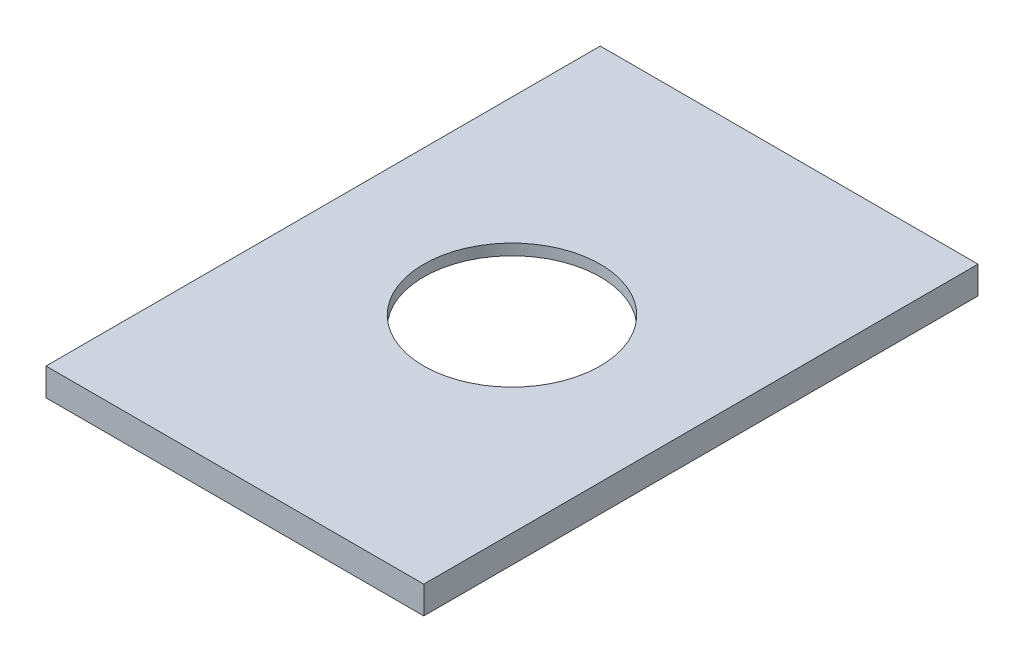
ISO-10303-21;
HEADER;
FILE_DESCRIPTION(('STEP AP214'),'2;1');
FILE_NAME('part.step','',(''),(''),'','','');
FILE_SCHEMA(('AUTOMOTIVE_DESIGN { 1 0 10303 214 1 1 1 1 }'));
ENDSEC;
DATA;
#1=APPLICATION_CONTEXT('core data for automotive mechanical design processes');
#2=APPLICATION_PROTOCOL_DEFINITION('international standard','automotive_design',2000,#1);
#3=PRODUCT_CONTEXT('',#1,'mechanical');
#4=PRODUCT('Part','Part','',(#3));
#5=PRODUCT_RELATED_PRODUCT_CATEGORY('part','',(#4));
#6=PRODUCT_DEFINITION_FORMATION('','',#4);
#7=PRODUCT_DEFINITION_CONTEXT('part definition',#1,'design');
#8=PRODUCT_DEFINITION('design','',#6,#7);
#9=PRODUCT_DEFINITION_SHAPE('','',#8);
#10=(LENGTH_UNIT() NAMED_UNIT(*) SI_UNIT(.MILLI.,.METRE.));
#11=(NAMED_UNIT(*) PLANE_ANGLE_UNIT() SI_UNIT($,.RADIAN.));
#12=(NAMED_UNIT(*) SI_UNIT($,.STERADIAN.) SOLID_ANGLE_UNIT());
#13=UNCERTAINTY_MEASURE_WITH_UNIT(LENGTH_MEASURE(1.E-05),#10,'distance_accuracy_value','');
#14=(GEOMETRIC_REPRESENTATION_CONTEXT(3) GLOBAL_UNCERTAINTY_ASSIGNED_CONTEXT((#13)) GLOBAL_UNIT_ASSIGNED_CONTEXT((#10,
#11,#12)) REPRESENTATION_CONTEXT('',''));
#15=CARTESIAN_POINT('',(0.,0.,0.));
#16=DIRECTION('',(0.,0.,1.));
#17=DIRECTION('',(1.,0.,0.));
#18=AXIS2_PLACEMENT_3D('',#15,#16,#17);
#19=CARTESIAN_POINT('',(0.,2.,0.));
#20=DIRECTION('',(0.,1.,0.));
#21=DIRECTION('',(0.,0.,1.));
#22=AXIS2_PLACEMENT_3D('',#19,#20,#21);
#23=PLANE('',#22);
#24=CARTESIAN_POINT('',(7.75,2.,11.25));
#25=DIRECTION('',(0.,1.,0.));
#26=DIRECTION('',(0.,0.,1.));
#27=AXIS2_PLACEMENT_3D('',#24,#25,#26);
#28=CIRCLE('',#27,16.);
#29=CARTESIAN_POINT('',(7.75,2.,27.25));
#30=VERTEX_POINT('',#29);
#31=EDGE_CURVE('E160',#30,#30,#28,.T.);
#32=ORIENTED_EDGE('',*,*,#31,.F.);
#33=EDGE_LOOP('',(#32));
#34=FACE_BOUND('',#33,.T.);
#35=DIRECTION('',(1.,0.,0.));
#36=VECTOR('',#35,1.);
#37=CARTESIAN_POINT('',(-26.5,2.,-39.));
#38=LINE('',#37,#36);
#39=CARTESIAN_POINT('',(-26.5,2.,-39.));
#40=VERTEX_POINT('',#39);
#41=CARTESIAN_POINT('',(42.,2.,-39.));
#42=VERTEX_POINT('',#41);
#43=EDGE_CURVE('E136',#40,#42,#38,.T.);
#44=ORIENTED_EDGE('',*,*,#43,.F.);
#45=DIRECTION('',(0.,0.,-1.));
#46=VECTOR('',#45,1.);
#47=CARTESIAN_POINT('',(-26.5,2.,61.5));
#48=LINE('',#47,#46);
#49=CARTESIAN_POINT('',(-26.5,2.,61.5));
#50=VERTEX_POINT('',#49);
#51=EDGE_CURVE('E145',#50,#40,#48,.T.);
#52=ORIENTED_EDGE('',*,*,#51,.F.);
#53=DIRECTION('',(-1.,0.,0.));
#54=VECTOR('',#53,1.);
#55=CARTESIAN_POINT('',(42.,2.,61.5));
#56=LINE('',#55,#54);
#57=CARTESIAN_POINT('',(42.,2.,61.5));
#58=VERTEX_POINT('',#57);
#59=EDGE_CURVE('E149',#58,#50,#56,.T.);
#60=ORIENTED_EDGE('',*,*,#59,.F.);
#61=DIRECTION('',(0.,0.,1.));
#62=VECTOR('',#61,1.);
#63=CARTESIAN_POINT('',(42.,2.,-39.));
#64=LINE('',#63,#62);
#65=EDGE_CURVE('E137',#42,#58,#64,.T.);
#66=ORIENTED_EDGE('',*,*,#65,.F.);
#67=EDGE_LOOP('',(#44,#52,#60,#66));
#68=FACE_BOUND('',#67,.T.);
#69=ADVANCED_FACE('F33',(#34,#68),#23,.T.);
#70=CARTESIAN_POINT('',(0.,0.,0.));
#71=DIRECTION('',(0.,1.,0.));
#72=DIRECTION('',(0.,0.,1.));
#73=AXIS2_PLACEMENT_3D('',#70,#71,#72);
#74=PLANE('',#73);
#75=DIRECTION('',(0.,0.,-1.));
#76=VECTOR('',#75,1.);
#77=CARTESIAN_POINT('',(40.,0.,-37.));
#78=LINE('',#77,#76);
#79=CARTESIAN_POINT('',(40.,0.,59.5));
#80=VERTEX_POINT('',#79);
#81=CARTESIAN_POINT('',(40.,0.,-37.));
#82=VERTEX_POINT('',#81);
#83=EDGE_CURVE('E48',#80,#82,#78,.T.);
#84=ORIENTED_EDGE('',*,*,#83,.F.);
#85=DIRECTION('',(1.,0.,0.));
#86=VECTOR('',#85,1.);
#87=CARTESIAN_POINT('',(-24.5,0.,59.5));
#88=LINE('',#87,#86);
#89=CARTESIAN_POINT('',(-24.5,0.,59.5));
#90=VERTEX_POINT('',#89);
#91=EDGE_CURVE('E11',#90,#80,#88,.T.);
#92=ORIENTED_EDGE('',*,*,#91,.F.);
#93=DIRECTION('',(0.,0.,1.));
#94=VECTOR('',#93,1.);
#95=CARTESIAN_POINT('',(-24.5,0.,-37.));
#96=LINE('',#95,#94);
#97=CARTESIAN_POINT('',(-24.5,0.,-37.));
#98=VERTEX_POINT('',#97);
#99=EDGE_CURVE('E41',#98,#90,#96,.T.);
#100=ORIENTED_EDGE('',*,*,#99,.F.);
#101=DIRECTION('',(-1.,0.,0.));
#102=VECTOR('',#101,1.);
#103=CARTESIAN_POINT('',(-24.5,0.,-37.));
#104=LINE('',#103,#102);
#105=EDGE_CURVE('E102',#82,#98,#104,.T.);
#106=ORIENTED_EDGE('',*,*,#105,.F.);
#107=EDGE_LOOP('',(#84,#92,#100,#106));
#108=FACE_BOUND('',#107,.T.);
#109=CARTESIAN_POINT('',(7.75,0.,11.25));
#110=DIRECTION('',(0.,1.,0.));
#111=DIRECTION('',(0.,0.,1.));
#112=AXIS2_PLACEMENT_3D('',#109,#110,#111);
#113=CIRCLE('',#112,16.);
#114=CARTESIAN_POINT('',(7.75,0.,27.25));
#115=VERTEX_POINT('',#114);
#116=EDGE_CURVE('E104',#115,#115,#113,.T.);
#117=ORIENTED_EDGE('',*,*,#116,.T.);
#118=EDGE_LOOP('',(#117));
#119=FACE_BOUND('',#118,.T.);
#120=ADVANCED_FACE('F35',(#108,#119),#74,.F.);
#121=CARTESIAN_POINT('',(7.75,2.,11.25));
#122=DIRECTION('',(0.,-1.,0.));
#123=DIRECTION('',(0.,0.,-1.));
#124=AXIS2_PLACEMENT_3D('',#121,#122,#123);
#125=CYLINDRICAL_SURFACE('',#124,16.);
#126=ORIENTED_EDGE('',*,*,#31,.T.);
#127=EDGE_LOOP('',(#126));
#128=FACE_BOUND('',#127,.T.);
#129=ORIENTED_EDGE('',*,*,#116,.F.);
#130=EDGE_LOOP('',(#129));
#131=FACE_BOUND('',#130,.T.);
#132=ADVANCED_FACE('F189',(#128,#131),#125,.F.);
#133=CARTESIAN_POINT('',(-24.5,123.624421889685,59.5));
#134=DIRECTION('',(0.,0.,1.));
#135=DIRECTION('',(1.,0.,0.));
#136=AXIS2_PLACEMENT_3D('',#133,#134,#135);
#137=PLANE('',#136);
#138=DIRECTION('',(0.,-1.,0.));
#139=VECTOR('',#138,1.);
#140=CARTESIAN_POINT('',(-24.5,123.624421889685,59.5));
#141=LINE('',#140,#139);
#142=CARTESIAN_POINT('',(-24.5,-3.,59.5));
#143=VERTEX_POINT('',#142);
#144=EDGE_CURVE('E111',#90,#143,#141,.T.);
#145=ORIENTED_EDGE('',*,*,#144,.F.);
#146=ORIENTED_EDGE('',*,*,#91,.T.);
#147=DIRECTION('',(0.,-1.,0.));
#148=VECTOR('',#147,1.);
#149=CARTESIAN_POINT('',(40.,123.624421889685,59.5));
#150=LINE('',#149,#148);
#151=CARTESIAN_POINT('',(40.,-3.,59.5));
#152=VERTEX_POINT('',#151);
#153=EDGE_CURVE('E157',#80,#152,#150,.T.);
#154=ORIENTED_EDGE('',*,*,#153,.T.);
#155=DIRECTION('',(-1.,0.,0.));
#156=VECTOR('',#155,1.);
#157=CARTESIAN_POINT('',(-24.5,-3.,59.5));
#158=LINE('',#157,#156);
#159=EDGE_CURVE('E120',#152,#143,#158,.T.);
#160=ORIENTED_EDGE('',*,*,#159,.T.);
#161=EDGE_LOOP('',(#145,#146,#154,#160));
#162=FACE_BOUND('',#161,.T.);
#163=ADVANCED_FACE('F167',(#162),#137,.F.);
#164=CARTESIAN_POINT('',(-24.5,123.624421889685,-37.));
#165=DIRECTION('',(0.,0.,-1.));
#166=DIRECTION('',(-1.,0.,0.));
#167=AXIS2_PLACEMENT_3D('',#164,#165,#166);
#168=PLANE('',#167);
#169=DIRECTION('',(0.,-1.,0.));
#170=VECTOR('',#169,1.);
#171=CARTESIAN_POINT('',(40.,123.624421889685,-37.));
#172=LINE('',#171,#170);
#173=CARTESIAN_POINT('',(40.,-3.,-37.));
#174=VERTEX_POINT('',#173);
#175=EDGE_CURVE('E105',#82,#174,#172,.T.);
#176=ORIENTED_EDGE('',*,*,#175,.F.);
#177=ORIENTED_EDGE('',*,*,#105,.T.);
#178=DIRECTION('',(0.,-1.,0.));
#179=VECTOR('',#178,1.);
#180=CARTESIAN_POINT('',(-24.5,123.624421889685,-37.));
#181=LINE('',#180,#179);
#182=CARTESIAN_POINT('',(-24.5,-3.,-37.));
#183=VERTEX_POINT('',#182);
#184=EDGE_CURVE('E95',#98,#183,#181,.T.);
#185=ORIENTED_EDGE('',*,*,#184,.T.);
#186=DIRECTION('',(1.,0.,0.));
#187=VECTOR('',#186,1.);
#188=CARTESIAN_POINT('',(-24.5,-3.,-37.));
#189=LINE('',#188,#187);
#190=EDGE_CURVE('E100',#183,#174,#189,.T.);
#191=ORIENTED_EDGE('',*,*,#190,.T.);
#192=EDGE_LOOP('',(#176,#177,#185,#191));
#193=FACE_BOUND('',#192,.T.);
#194=ADVANCED_FACE('F98',(#193),#168,.F.);
#195=CARTESIAN_POINT('',(-24.5,123.624421889685,59.5));
#196=DIRECTION('',(-1.,0.,0.));
#197=DIRECTION('',(0.,0.,1.));
#198=AXIS2_PLACEMENT_3D('',#195,#196,#197);
#199=PLANE('',#198);
#200=ORIENTED_EDGE('',*,*,#184,.F.);
#201=ORIENTED_EDGE('',*,*,#99,.T.);
#202=ORIENTED_EDGE('',*,*,#144,.T.);
#203=DIRECTION('',(0.,0.,-1.));
#204=VECTOR('',#203,1.);
#205=CARTESIAN_POINT('',(-24.5,-3.,59.5));
#206=LINE('',#205,#204);
#207=EDGE_CURVE('E108',#143,#183,#206,.T.);
#208=ORIENTED_EDGE('',*,*,#207,.T.);
#209=EDGE_LOOP('',(#200,#201,#202,#208));
#210=FACE_BOUND('',#209,.T.);
#211=ADVANCED_FACE('F109',(#210),#199,.F.);
#212=CARTESIAN_POINT('',(40.,123.624421889685,59.5));
#213=DIRECTION('',(1.,0.,0.));
#214=DIRECTION('',(0.,0.,-1.));
#215=AXIS2_PLACEMENT_3D('',#212,#213,#214);
#216=PLANE('',#215);
#217=ORIENTED_EDGE('',*,*,#153,.F.);
#218=ORIENTED_EDGE('',*,*,#83,.T.);
#219=ORIENTED_EDGE('',*,*,#175,.T.);
#220=DIRECTION('',(0.,0.,1.));
#221=VECTOR('',#220,1.);
#222=CARTESIAN_POINT('',(40.,-3.,59.5));
#223=LINE('',#222,#221);
#224=EDGE_CURVE('E118',#174,#152,#223,.T.);
#225=ORIENTED_EDGE('',*,*,#224,.T.);
#226=EDGE_LOOP('',(#217,#218,#219,#225));
#227=FACE_BOUND('',#226,.T.);
#228=ADVANCED_FACE('F170',(#227),#216,.F.);
#229=CARTESIAN_POINT('',(-26.5,123.624421889685,-39.));
#230=DIRECTION('',(0.,0.,-1.));
#231=DIRECTION('',(-1.,0.,0.));
#232=AXIS2_PLACEMENT_3D('',#229,#230,#231);
#233=PLANE('',#232);
#234=DIRECTION('',(0.,-1.,0.));
#235=VECTOR('',#234,1.);
#236=CARTESIAN_POINT('',(-26.5,123.624421889685,-39.));
#237=LINE('',#236,#235);
#238=CARTESIAN_POINT('',(-26.5,-3.,-39.));
#239=VERTEX_POINT('',#238);
#240=EDGE_CURVE('E148',#40,#239,#237,.T.);
#241=ORIENTED_EDGE('',*,*,#240,.F.);
#242=ORIENTED_EDGE('',*,*,#43,.T.);
#243=DIRECTION('',(0.,-1.,0.));
#244=VECTOR('',#243,1.);
#245=CARTESIAN_POINT('',(42.,123.624421889685,-39.));
#246=LINE('',#245,#244);
#247=CARTESIAN_POINT('',(42.,-3.,-39.));
#248=VERTEX_POINT('',#247);
#249=EDGE_CURVE('E144',#42,#248,#246,.T.);
#250=ORIENTED_EDGE('',*,*,#249,.T.);
#251=DIRECTION('',(1.,0.,0.));
#252=VECTOR('',#251,1.);
#253=CARTESIAN_POINT('',(-26.5,-3.,-39.));
#254=LINE('',#253,#252);
#255=EDGE_CURVE('E124',#239,#248,#254,.T.);
#256=ORIENTED_EDGE('',*,*,#255,.F.);
#257=EDGE_LOOP('',(#241,#242,#250,#256));
#258=FACE_BOUND('',#257,.T.);
#259=ADVANCED_FACE('F172',(#258),#233,.T.);
#260=CARTESIAN_POINT('',(-26.5,123.624421889685,61.5));
#261=DIRECTION('',(-1.,0.,0.));
#262=DIRECTION('',(0.,0.,1.));
#263=AXIS2_PLACEMENT_3D('',#260,#261,#262);
#264=PLANE('',#263);
#265=DIRECTION('',(0.,-1.,0.));
#266=VECTOR('',#265,1.);
#267=CARTESIAN_POINT('',(-26.5,123.624421889685,61.5));
#268=LINE('',#267,#266);
#269=CARTESIAN_POINT('',(-26.5,-3.,61.5));
#270=VERTEX_POINT('',#269);
#271=EDGE_CURVE('E141',#50,#270,#268,.T.);
#272=ORIENTED_EDGE('',*,*,#271,.F.);
#273=ORIENTED_EDGE('',*,*,#51,.T.);
#274=ORIENTED_EDGE('',*,*,#240,.T.);
#275=DIRECTION('',(0.,0.,-1.));
#276=VECTOR('',#275,1.);
#277=CARTESIAN_POINT('',(-26.5,-3.,61.5));
#278=LINE('',#277,#276);
#279=EDGE_CURVE('E133',#270,#239,#278,.T.);
#280=ORIENTED_EDGE('',*,*,#279,.F.);
#281=EDGE_LOOP('',(#272,#273,#274,#280));
#282=FACE_BOUND('',#281,.T.);
#283=ADVANCED_FACE('F178',(#282),#264,.T.);
#284=CARTESIAN_POINT('',(42.,123.624421889685,61.5));
#285=DIRECTION('',(0.,0.,1.));
#286=DIRECTION('',(1.,0.,0.));
#287=AXIS2_PLACEMENT_3D('',#284,#285,#286);
#288=PLANE('',#287);
#289=DIRECTION('',(0.,-1.,0.));
#290=VECTOR('',#289,1.);
#291=CARTESIAN_POINT('',(42.,123.624421889685,61.5));
#292=LINE('',#291,#290);
#293=CARTESIAN_POINT('',(42.,-3.,61.5));
#294=VERTEX_POINT('',#293);
#295=EDGE_CURVE('E140',#58,#294,#292,.T.);
#296=ORIENTED_EDGE('',*,*,#295,.F.);
#297=ORIENTED_EDGE('',*,*,#59,.T.);
#298=ORIENTED_EDGE('',*,*,#271,.T.);
#299=DIRECTION('',(-1.,0.,0.));
#300=VECTOR('',#299,1.);
#301=CARTESIAN_POINT('',(42.,-3.,61.5));
#302=LINE('',#301,#300);
#303=EDGE_CURVE('E130',#294,#270,#302,.T.);
#304=ORIENTED_EDGE('',*,*,#303,.F.);
#305=EDGE_LOOP('',(#296,#297,#298,#304));
#306=FACE_BOUND('',#305,.T.);
#307=ADVANCED_FACE('F204',(#306),#288,.T.);
#308=CARTESIAN_POINT('',(42.,123.624421889685,-39.));
#309=DIRECTION('',(1.,0.,0.));
#310=DIRECTION('',(0.,0.,-1.));
#311=AXIS2_PLACEMENT_3D('',#308,#309,#310);
#312=PLANE('',#311);
#313=ORIENTED_EDGE('',*,*,#249,.F.);
#314=ORIENTED_EDGE('',*,*,#65,.T.);
#315=ORIENTED_EDGE('',*,*,#295,.T.);
#316=DIRECTION('',(0.,0.,1.));
#317=VECTOR('',#316,1.);
#318=CARTESIAN_POINT('',(42.,-3.,-39.));
#319=LINE('',#318,#317);
#320=EDGE_CURVE('E127',#248,#294,#319,.T.);
#321=ORIENTED_EDGE('',*,*,#320,.F.);
#322=EDGE_LOOP('',(#313,#314,#315,#321));
#323=FACE_BOUND('',#322,.T.);
#324=ADVANCED_FACE('F208',(#323),#312,.T.);
#325=CARTESIAN_POINT('',(0.,-3.,0.));
#326=DIRECTION('',(0.,-1.,0.));
#327=DIRECTION('',(0.,0.,-1.));
#328=AXIS2_PLACEMENT_3D('',#325,#326,#327);
#329=PLANE('',#328);
#330=ORIENTED_EDGE('',*,*,#255,.T.);
#331=ORIENTED_EDGE('',*,*,#320,.T.);
#332=ORIENTED_EDGE('',*,*,#303,.T.);
#333=ORIENTED_EDGE('',*,*,#279,.T.);
#334=EDGE_LOOP('',(#330,#331,#332,#333));
#335=FACE_BOUND('',#334,.T.);
#336=ORIENTED_EDGE('',*,*,#190,.F.);
#337=ORIENTED_EDGE('',*,*,#207,.F.);
#338=ORIENTED_EDGE('',*,*,#159,.F.);
#339=ORIENTED_EDGE('',*,*,#224,.F.);
#340=EDGE_LOOP('',(#336,#337,#338,#339));
#341=FACE_BOUND('',#340,.T.);
#342=ADVANCED_FACE('F116',(#335,#341),#329,.T.);
#343=CLOSED_SHELL('',(#69,#120,#132,#163,#194,#211,#228,#259,#283,#307,#324,#342));
#344=MANIFOLD_SOLID_BREP('B2',#343);
#345=ADVANCED_BREP_SHAPE_REPRESENTATION('',(#18,#344),#14);
#346=SHAPE_DEFINITION_REPRESENTATION(#9,#345);
ENDSEC;
END-ISO-10303-21;
